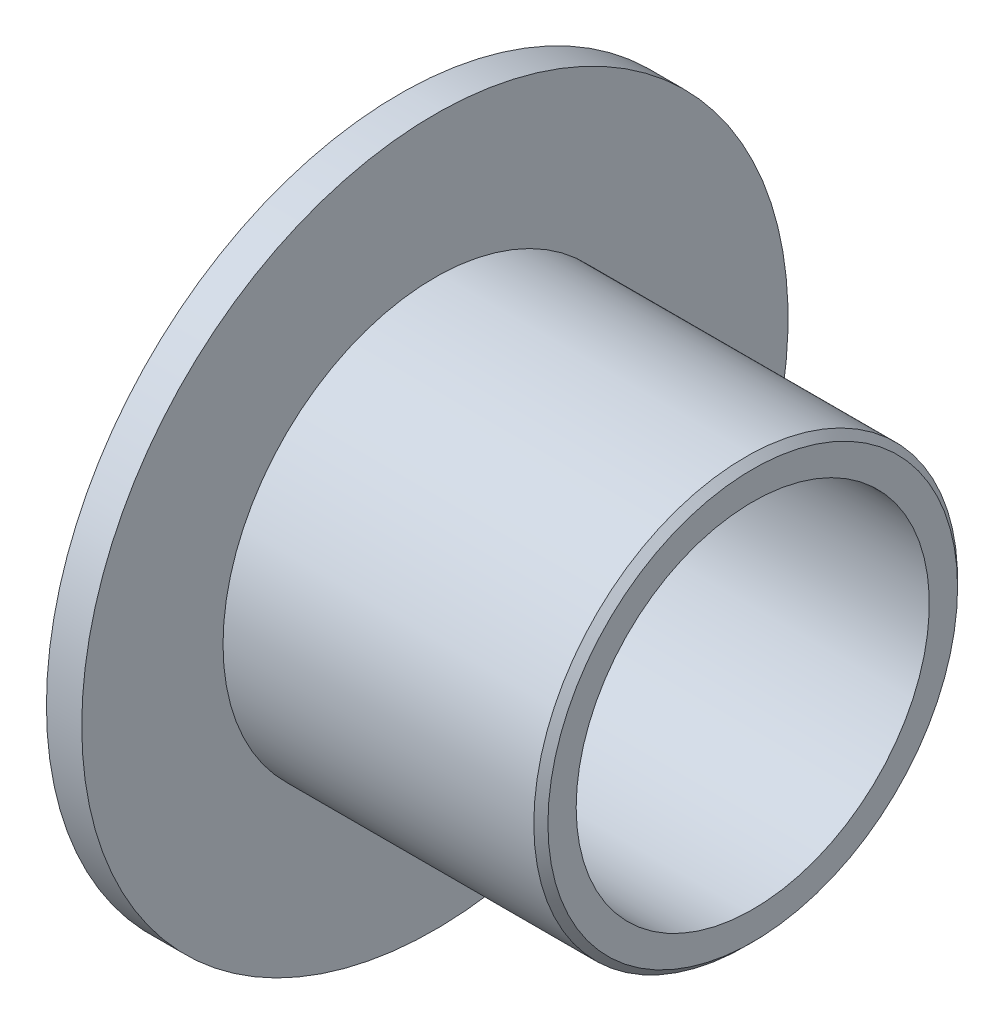
ISO-10303-21;
HEADER;
FILE_DESCRIPTION(('STEP AP214'),'2;1');
FILE_NAME('part.step','',(''),(''),'','','');
FILE_SCHEMA(('AUTOMOTIVE_DESIGN { 1 0 10303 214 1 1 1 1 }'));
ENDSEC;
DATA;
#1=APPLICATION_CONTEXT('core data for automotive mechanical design processes');
#2=APPLICATION_PROTOCOL_DEFINITION('international standard','automotive_design',2000,#1);
#3=PRODUCT_CONTEXT('',#1,'mechanical');
#4=PRODUCT('Part','Part','',(#3));
#5=PRODUCT_RELATED_PRODUCT_CATEGORY('part','',(#4));
#6=PRODUCT_DEFINITION_FORMATION('','',#4);
#7=PRODUCT_DEFINITION_CONTEXT('part definition',#1,'design');
#8=PRODUCT_DEFINITION('design','',#6,#7);
#9=PRODUCT_DEFINITION_SHAPE('','',#8);
#10=(LENGTH_UNIT() NAMED_UNIT(*) SI_UNIT(.MILLI.,.METRE.));
#11=(NAMED_UNIT(*) PLANE_ANGLE_UNIT() SI_UNIT($,.RADIAN.));
#12=(NAMED_UNIT(*) SI_UNIT($,.STERADIAN.) SOLID_ANGLE_UNIT());
#13=UNCERTAINTY_MEASURE_WITH_UNIT(LENGTH_MEASURE(1.E-05),#10,'distance_accuracy_value','');
#14=(GEOMETRIC_REPRESENTATION_CONTEXT(3) GLOBAL_UNCERTAINTY_ASSIGNED_CONTEXT((#13)) GLOBAL_UNIT_ASSIGNED_CONTEXT((#10,
#11,#12)) REPRESENTATION_CONTEXT('',''));
#15=CARTESIAN_POINT('',(0.,0.,0.));
#16=DIRECTION('',(0.,0.,1.));
#17=DIRECTION('',(1.,0.,0.));
#18=AXIS2_PLACEMENT_3D('',#15,#16,#17);
#19=CARTESIAN_POINT('',(0.,0.,0.));
#20=DIRECTION('',(-1.,0.,0.));
#21=DIRECTION('',(0.,0.,1.));
#22=AXIS2_PLACEMENT_3D('',#19,#20,#21);
#23=CYLINDRICAL_SURFACE('',#22,5.);
#24=CARTESIAN_POINT('',(0.,0.,0.));
#25=DIRECTION('',(-1.,0.,0.));
#26=DIRECTION('',(0.,0.,1.));
#27=AXIS2_PLACEMENT_3D('',#24,#25,#26);
#28=CIRCLE('',#27,5.);
#29=CARTESIAN_POINT('',(0.,0.,5.));
#30=VERTEX_POINT('',#29);
#31=EDGE_CURVE('E25',#30,#30,#28,.T.);
#32=ORIENTED_EDGE('',*,*,#31,.F.);
#33=EDGE_LOOP('',(#32));
#34=FACE_BOUND('',#33,.T.);
#35=CARTESIAN_POINT('',(0.5,0.,0.));
#36=DIRECTION('',(-1.,0.,0.));
#37=DIRECTION('',(0.,0.,1.));
#38=AXIS2_PLACEMENT_3D('',#35,#36,#37);
#39=CIRCLE('',#38,5.);
#40=CARTESIAN_POINT('',(0.5,0.,5.));
#41=VERTEX_POINT('',#40);
#42=EDGE_CURVE('E40',#41,#41,#39,.T.);
#43=ORIENTED_EDGE('',*,*,#42,.T.);
#44=EDGE_LOOP('',(#43));
#45=FACE_BOUND('',#44,.T.);
#46=ADVANCED_FACE('F14',(#34,#45),#23,.T.);
#47=CARTESIAN_POINT('',(0.,5.,0.));
#48=DIRECTION('',(1.,0.,0.));
#49=DIRECTION('',(0.,0.,-1.));
#50=AXIS2_PLACEMENT_3D('',#47,#48,#49);
#51=PLANE('',#50);
#52=CARTESIAN_POINT('',(0.,0.,0.));
#53=DIRECTION('',(-1.,0.,0.));
#54=DIRECTION('',(0.,0.,1.));
#55=AXIS2_PLACEMENT_3D('',#52,#53,#54);
#56=CIRCLE('',#55,2.5);
#57=CARTESIAN_POINT('',(0.,0.,2.5));
#58=VERTEX_POINT('',#57);
#59=EDGE_CURVE('E29',#58,#58,#56,.T.);
#60=ORIENTED_EDGE('',*,*,#59,.F.);
#61=EDGE_LOOP('',(#60));
#62=FACE_BOUND('',#61,.T.);
#63=ORIENTED_EDGE('',*,*,#31,.T.);
#64=EDGE_LOOP('',(#63));
#65=FACE_BOUND('',#64,.T.);
#66=ADVANCED_FACE('F62',(#62,#65),#51,.F.);
#67=CARTESIAN_POINT('',(0.,0.,0.));
#68=DIRECTION('',(-1.,0.,0.));
#69=DIRECTION('',(0.,0.,1.));
#70=AXIS2_PLACEMENT_3D('',#67,#68,#69);
#71=CYLINDRICAL_SURFACE('',#70,2.5);
#72=CARTESIAN_POINT('',(5.,0.,0.));
#73=DIRECTION('',(-1.,0.,0.));
#74=DIRECTION('',(0.,0.,1.));
#75=AXIS2_PLACEMENT_3D('',#72,#73,#74);
#76=CIRCLE('',#75,2.5);
#77=CARTESIAN_POINT('',(5.,0.,2.5));
#78=VERTEX_POINT('',#77);
#79=EDGE_CURVE('E34',#78,#78,#76,.T.);
#80=ORIENTED_EDGE('',*,*,#79,.F.);
#81=EDGE_LOOP('',(#80));
#82=FACE_BOUND('',#81,.T.);
#83=ORIENTED_EDGE('',*,*,#59,.T.);
#84=EDGE_LOOP('',(#83));
#85=FACE_BOUND('',#84,.T.);
#86=ADVANCED_FACE('F59',(#82,#85),#71,.F.);
#87=CARTESIAN_POINT('',(5.,2.5,0.));
#88=DIRECTION('',(-1.,0.,0.));
#89=DIRECTION('',(0.,0.,1.));
#90=AXIS2_PLACEMENT_3D('',#87,#88,#89);
#91=PLANE('',#90);
#92=CARTESIAN_POINT('',(5.,0.,0.));
#93=DIRECTION('',(-1.,0.,0.));
#94=DIRECTION('',(0.,0.,1.));
#95=AXIS2_PLACEMENT_3D('',#92,#93,#94);
#96=CIRCLE('',#95,2.9);
#97=CARTESIAN_POINT('',(5.,0.,2.9));
#98=VERTEX_POINT('',#97);
#99=EDGE_CURVE('E10',#98,#98,#96,.F.);
#100=ORIENTED_EDGE('',*,*,#99,.T.);
#101=EDGE_LOOP('',(#100));
#102=FACE_BOUND('',#101,.T.);
#103=ORIENTED_EDGE('',*,*,#79,.T.);
#104=EDGE_LOOP('',(#103));
#105=FACE_BOUND('',#104,.T.);
#106=ADVANCED_FACE('F53',(#102,#105),#91,.F.);
#107=CARTESIAN_POINT('',(0.,0.,0.));
#108=DIRECTION('',(-1.,0.,0.));
#109=DIRECTION('',(0.,0.,1.));
#110=AXIS2_PLACEMENT_3D('',#107,#108,#109);
#111=CYLINDRICAL_SURFACE('',#110,3.);
#112=CARTESIAN_POINT('',(4.9,0.,0.));
#113=DIRECTION('',(-1.,0.,0.));
#114=DIRECTION('',(0.,0.,1.));
#115=AXIS2_PLACEMENT_3D('',#112,#113,#114);
#116=CIRCLE('',#115,3.);
#117=CARTESIAN_POINT('',(4.9,0.,3.));
#118=VERTEX_POINT('',#117);
#119=EDGE_CURVE('E21',#118,#118,#116,.T.);
#120=ORIENTED_EDGE('',*,*,#119,.T.);
#121=EDGE_LOOP('',(#120));
#122=FACE_BOUND('',#121,.T.);
#123=CARTESIAN_POINT('',(0.5,0.,0.));
#124=DIRECTION('',(-1.,0.,0.));
#125=DIRECTION('',(0.,0.,1.));
#126=AXIS2_PLACEMENT_3D('',#123,#124,#125);
#127=CIRCLE('',#126,3.);
#128=CARTESIAN_POINT('',(0.5,0.,3.));
#129=VERTEX_POINT('',#128);
#130=EDGE_CURVE('E37',#129,#129,#127,.T.);
#131=ORIENTED_EDGE('',*,*,#130,.F.);
#132=EDGE_LOOP('',(#131));
#133=FACE_BOUND('',#132,.T.);
#134=ADVANCED_FACE('F48',(#122,#133),#111,.T.);
#135=CARTESIAN_POINT('',(0.5,3.,0.));
#136=DIRECTION('',(-1.,0.,0.));
#137=DIRECTION('',(0.,0.,1.));
#138=AXIS2_PLACEMENT_3D('',#135,#136,#137);
#139=PLANE('',#138);
#140=ORIENTED_EDGE('',*,*,#42,.F.);
#141=EDGE_LOOP('',(#140));
#142=FACE_BOUND('',#141,.T.);
#143=ORIENTED_EDGE('',*,*,#130,.T.);
#144=EDGE_LOOP('',(#143));
#145=FACE_BOUND('',#144,.T.);
#146=ADVANCED_FACE('F45',(#142,#145),#139,.F.);
#147=CARTESIAN_POINT('',(4.9,0.,0.));
#148=DIRECTION('',(-1.,0.,0.));
#149=DIRECTION('',(0.,0.,1.));
#150=AXIS2_PLACEMENT_3D('',#147,#148,#149);
#151=CONICAL_SURFACE('',#150,3.,0.785398163397442);
#152=ORIENTED_EDGE('',*,*,#99,.F.);
#153=EDGE_LOOP('',(#152));
#154=FACE_BOUND('',#153,.T.);
#155=ORIENTED_EDGE('',*,*,#119,.F.);
#156=EDGE_LOOP('',(#155));
#157=FACE_BOUND('',#156,.T.);
#158=ADVANCED_FACE('F16',(#154,#157),#151,.T.);
#159=CLOSED_SHELL('',(#46,#66,#86,#106,#134,#146,#158));
#160=MANIFOLD_SOLID_BREP('B1',#159);
#161=ADVANCED_BREP_SHAPE_REPRESENTATION('',(#18,#160),#14);
#162=SHAPE_DEFINITION_REPRESENTATION(#9,#161);
ENDSEC;
END-ISO-10303-21;
